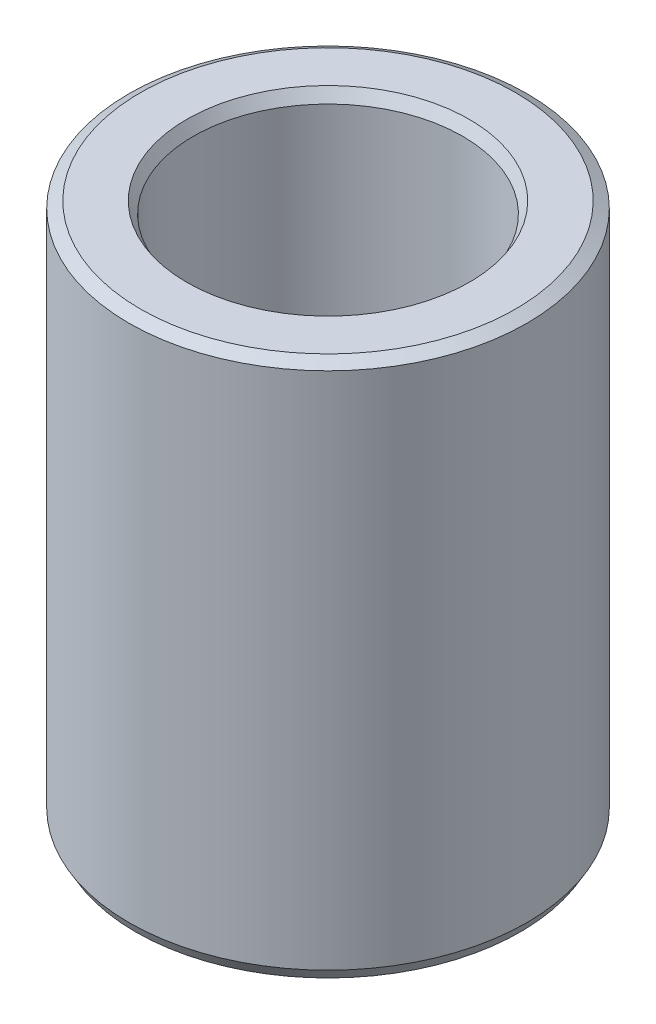
ISO-10303-21;
HEADER;
FILE_DESCRIPTION(('STEP AP214'),'2;1');
FILE_NAME('part.step','',(''),(''),'','','');
FILE_SCHEMA(('AUTOMOTIVE_DESIGN { 1 0 10303 214 1 1 1 1 }'));
ENDSEC;
DATA;
#1=APPLICATION_CONTEXT('core data for automotive mechanical design processes');
#2=APPLICATION_PROTOCOL_DEFINITION('international standard','automotive_design',2000,#1);
#3=PRODUCT_CONTEXT('',#1,'mechanical');
#4=PRODUCT('Part','Part','',(#3));
#5=PRODUCT_RELATED_PRODUCT_CATEGORY('part','',(#4));
#6=PRODUCT_DEFINITION_FORMATION('','',#4);
#7=PRODUCT_DEFINITION_CONTEXT('part definition',#1,'design');
#8=PRODUCT_DEFINITION('design','',#6,#7);
#9=PRODUCT_DEFINITION_SHAPE('','',#8);
#10=(LENGTH_UNIT() NAMED_UNIT(*) SI_UNIT(.MILLI.,.METRE.));
#11=(NAMED_UNIT(*) PLANE_ANGLE_UNIT() SI_UNIT($,.RADIAN.));
#12=(NAMED_UNIT(*) SI_UNIT($,.STERADIAN.) SOLID_ANGLE_UNIT());
#13=UNCERTAINTY_MEASURE_WITH_UNIT(LENGTH_MEASURE(1.E-05),#10,'distance_accuracy_value','');
#14=(GEOMETRIC_REPRESENTATION_CONTEXT(3) GLOBAL_UNCERTAINTY_ASSIGNED_CONTEXT((#13)) GLOBAL_UNIT_ASSIGNED_CONTEXT((#10,
#11,#12)) REPRESENTATION_CONTEXT('',''));
#15=CARTESIAN_POINT('',(0.,0.,0.));
#16=DIRECTION('',(0.,0.,1.));
#17=DIRECTION('',(1.,0.,0.));
#18=AXIS2_PLACEMENT_3D('',#15,#16,#17);
#19=CARTESIAN_POINT('',(0.,155.236634701129,0.));
#20=DIRECTION('',(0.,-1.,0.));
#21=DIRECTION('',(0.,0.,-1.));
#22=AXIS2_PLACEMENT_3D('',#19,#20,#21);
#23=CYLINDRICAL_SURFACE('',#22,57.5);
#24=CARTESIAN_POINT('',(0.,3.29462946241038,0.));
#25=DIRECTION('',(0.,1.,0.));
#26=DIRECTION('',(0.,0.,1.));
#27=AXIS2_PLACEMENT_3D('',#24,#25,#26);
#28=CIRCLE('',#27,57.5);
#29=CARTESIAN_POINT('',(0.,3.29462946241035,-57.5));
#30=VERTEX_POINT('',#29);
#31=EDGE_CURVE('E10',#30,#30,#28,.T.);
#32=CARTESIAN_POINT('',(0.,153.334479494126,0.));
#33=DIRECTION('',(0.,1.,0.));
#34=DIRECTION('',(0.,0.,1.));
#35=AXIS2_PLACEMENT_3D('',#32,#33,#34);
#36=CIRCLE('',#35,57.5);
#37=CARTESIAN_POINT('',(0.,153.334479494126,-57.5));
#38=VERTEX_POINT('',#37);
#39=EDGE_CURVE('E50',#38,#38,#36,.F.);
#40=CARTESIAN_POINT('',(0.,3.29462946241035,-57.5));
#41=CARTESIAN_POINT('',(0.,4.85754456690739,-57.5));
#42=CARTESIAN_POINT('',(0.,6.42045967140443,-57.5));
#43=CARTESIAN_POINT('',(0.,9.54628988039851,-57.5));
#44=CARTESIAN_POINT('',(0.,11.1092049848955,-57.5));
#45=CARTESIAN_POINT('',(0.,14.2350351938896,-57.5));
#46=CARTESIAN_POINT('',(0.,15.7979502983867,-57.5));
#47=CARTESIAN_POINT('',(0.,18.9237805073807,-57.5));
#48=CARTESIAN_POINT('',(0.,20.4866956118778,-57.5));
#49=CARTESIAN_POINT('',(0.,23.6125258208719,-57.5));
#50=CARTESIAN_POINT('',(0.,25.1754409253689,-57.5));
#51=CARTESIAN_POINT('',(0.,28.301271134363,-57.5));
#52=CARTESIAN_POINT('',(0.,29.86418623886,-57.5));
#53=CARTESIAN_POINT('',(0.,32.9900164478541,-57.5));
#54=CARTESIAN_POINT('',(0.,34.5529315523511,-57.5));
#55=CARTESIAN_POINT('',(0.,37.6787617613452,-57.5));
#56=CARTESIAN_POINT('',(0.,39.2416768658423,-57.5));
#57=CARTESIAN_POINT('',(0.,42.3675070748363,-57.5));
#58=CARTESIAN_POINT('',(0.,43.9304221793334,-57.5));
#59=CARTESIAN_POINT('',(0.,47.0562523883275,-57.5));
#60=CARTESIAN_POINT('',(0.,48.6191674928245,-57.5));
#61=CARTESIAN_POINT('',(0.,51.7449977018186,-57.5));
#62=CARTESIAN_POINT('',(0.,53.3079128063156,-57.5));
#63=CARTESIAN_POINT('',(0.,56.4337430153097,-57.5));
#64=CARTESIAN_POINT('',(0.,57.9966581198067,-57.5));
#65=CARTESIAN_POINT('',(0.,61.1224883288008,-57.5));
#66=CARTESIAN_POINT('',(0.,62.6854034332979,-57.5));
#67=CARTESIAN_POINT('',(0.,65.8112336422919,-57.5));
#68=CARTESIAN_POINT('',(0.,67.374148746789,-57.5));
#69=CARTESIAN_POINT('',(0.,70.4999789557831,-57.5));
#70=CARTESIAN_POINT('',(0.,72.0628940602801,-57.5));
#71=CARTESIAN_POINT('',(0.,75.1887242692742,-57.5));
#72=CARTESIAN_POINT('',(0.,76.7516393737712,-57.5));
#73=CARTESIAN_POINT('',(0.,79.8774695827653,-57.5));
#74=CARTESIAN_POINT('',(0.,81.4403846872624,-57.5));
#75=CARTESIAN_POINT('',(0.,84.5662148962564,-57.5));
#76=CARTESIAN_POINT('',(0.,86.1291300007535,-57.5));
#77=CARTESIAN_POINT('',(0.,89.2549602097476,-57.5));
#78=CARTESIAN_POINT('',(0.,90.8178753142446,-57.5));
#79=CARTESIAN_POINT('',(0.,93.9437055232387,-57.5));
#80=CARTESIAN_POINT('',(0.,95.5066206277357,-57.5));
#81=CARTESIAN_POINT('',(0.,98.6324508367298,-57.5));
#82=CARTESIAN_POINT('',(0.,100.195365941227,-57.5));
#83=CARTESIAN_POINT('',(0.,103.321196150221,-57.5));
#84=CARTESIAN_POINT('',(0.,104.884111254718,-57.5));
#85=CARTESIAN_POINT('',(0.,108.009941463712,-57.5));
#86=CARTESIAN_POINT('',(0.,109.572856568209,-57.5));
#87=CARTESIAN_POINT('',(0.,112.698686777203,-57.5));
#88=CARTESIAN_POINT('',(0.,114.2616018817,-57.5));
#89=CARTESIAN_POINT('',(0.,117.387432090694,-57.5));
#90=CARTESIAN_POINT('',(0.,118.950347195191,-57.5));
#91=CARTESIAN_POINT('',(0.,122.076177404185,-57.5));
#92=CARTESIAN_POINT('',(0.,123.639092508682,-57.5));
#93=CARTESIAN_POINT('',(0.,126.764922717676,-57.5));
#94=CARTESIAN_POINT('',(0.,128.327837822174,-57.5));
#95=CARTESIAN_POINT('',(0.,131.453668031168,-57.5));
#96=CARTESIAN_POINT('',(0.,133.016583135665,-57.5));
#97=CARTESIAN_POINT('',(0.,136.142413344659,-57.5));
#98=CARTESIAN_POINT('',(0.,137.705328449156,-57.5));
#99=CARTESIAN_POINT('',(0.,140.83115865815,-57.5));
#100=CARTESIAN_POINT('',(0.,142.394073762647,-57.5));
#101=CARTESIAN_POINT('',(0.,145.519903971641,-57.5));
#102=CARTESIAN_POINT('',(0.,147.082819076138,-57.5));
#103=CARTESIAN_POINT('',(0.,150.208649285132,-57.5));
#104=CARTESIAN_POINT('',(0.,151.771564389629,-57.5));
#105=CARTESIAN_POINT('',(0.,153.334479494126,-57.5));
#106=B_SPLINE_CURVE_WITH_KNOTS('',3,(#40,#41,#42,#43,#44,#45,#46,#47,#48,#49,#50,#51,#52,#53,
#54,#55,#56,#57,#58,#59,#60,#61,#62,#63,#64,#65,#66,#67,#68,#69,#70,#71,#72,#73,#74,#75,#76,#77,
#78,#79,#80,#81,#82,#83,#84,#85,#86,#87,#88,#89,#90,#91,#92,#93,#94,#95,#96,#97,#98,#99,#100,
#101,#102,#103,#104,#105),.UNSPECIFIED.,.F.,.F.,(4,2,2,2,2,2,2,2,2,2,2,2,2,2,2,2,2,2,2,2,2,2,2,
2,2,2,2,2,2,2,2,2,4),(0.,4.68874531349112,9.37749062698223,14.0662359404733,18.7549812539645,
23.4437265674556,28.1324718809467,32.8212171944378,37.5099625079289,42.1987078214201,
46.8874531349112,51.5761984484023,56.2649437618934,60.9536890753846,65.6424343888757,
70.3311797023668,75.0199250158579,79.708670329349,84.3974156428402,89.0861609563313,
93.7749062698224,98.4636515833135,103.152396896805,107.841142210296,112.529887523787,
117.218632837278,121.907378150769,126.59612346426,131.284868777751,135.973614091242,
140.662359404734,145.351104718225,150.039850031716),.UNSPECIFIED.);
#107=EDGE_CURVE('BSEAM39',#30,#38,#106,.T.);
#108=ORIENTED_EDGE('',*,*,#31,.T.);
#109=ORIENTED_EDGE('',*,*,#39,.T.);
#110=ORIENTED_EDGE('',*,*,#107,.T.);
#111=ORIENTED_EDGE('',*,*,#107,.F.);
#112=EDGE_LOOP('',(#108,#110,#109,#111));
#113=FACE_BOUND('',#112,.T.);
#114=ADVANCED_FACE('F39',(#113),#23,.T.);
#115=CARTESIAN_POINT('',(0.,155.236634701129,0.));
#116=DIRECTION('',(0.,1.,0.));
#117=DIRECTION('',(0.,0.,1.));
#118=AXIS2_PLACEMENT_3D('',#115,#116,#117);
#119=PLANE('',#118);
#120=CARTESIAN_POINT('',(0.,155.236634701129,0.));
#121=DIRECTION('',(0.,1.,0.));
#122=DIRECTION('',(0.,0.,1.));
#123=AXIS2_PLACEMENT_3D('',#120,#121,#122);
#124=CIRCLE('',#123,40.829257952996);
#125=CARTESIAN_POINT('',(0.,155.236634701129,40.829257952996));
#126=VERTEX_POINT('',#125);
#127=EDGE_CURVE('E58',#126,#126,#124,.F.);
#128=ORIENTED_EDGE('',*,*,#127,.T.);
#129=EDGE_LOOP('',(#128));
#130=FACE_BOUND('',#129,.T.);
#131=CARTESIAN_POINT('',(0.,155.236634701129,0.));
#132=DIRECTION('',(0.,1.,0.));
#133=DIRECTION('',(0.,0.,1.));
#134=AXIS2_PLACEMENT_3D('',#131,#132,#133);
#135=CIRCLE('',#134,54.2053705375901);
#136=CARTESIAN_POINT('',(0.,155.236634701129,54.2053705375901));
#137=VERTEX_POINT('',#136);
#138=EDGE_CURVE('E61',#137,#137,#135,.T.);
#139=ORIENTED_EDGE('',*,*,#138,.T.);
#140=EDGE_LOOP('',(#139));
#141=FACE_BOUND('',#140,.T.);
#142=ADVANCED_FACE('F88',(#130,#141),#119,.T.);
#143=CARTESIAN_POINT('',(0.,0.,0.));
#144=DIRECTION('',(0.,1.,0.));
#145=DIRECTION('',(0.,0.,1.));
#146=AXIS2_PLACEMENT_3D('',#143,#144,#145);
#147=PLANE('',#146);
#148=CARTESIAN_POINT('',(0.,0.,0.));
#149=DIRECTION('',(0.,1.,0.));
#150=DIRECTION('',(0.,0.,1.));
#151=AXIS2_PLACEMENT_3D('',#148,#149,#150);
#152=CIRCLE('',#151,42.2217322084032);
#153=CARTESIAN_POINT('',(0.,0.,-42.2217322084032));
#154=VERTEX_POINT('',#153);
#155=EDGE_CURVE('E51',#154,#154,#152,.T.);
#156=ORIENTED_EDGE('',*,*,#155,.T.);
#157=EDGE_LOOP('',(#156));
#158=FACE_BOUND('',#157,.T.);
#159=CARTESIAN_POINT('',(0.,0.,0.));
#160=DIRECTION('',(0.,1.,0.));
#161=DIRECTION('',(0.,0.,1.));
#162=AXIS2_PLACEMENT_3D('',#159,#160,#161);
#163=CIRCLE('',#162,55.5978447929973);
#164=CARTESIAN_POINT('',(0.,0.,55.5978447929973));
#165=VERTEX_POINT('',#164);
#166=EDGE_CURVE('E54',#165,#165,#163,.F.);
#167=ORIENTED_EDGE('',*,*,#166,.T.);
#168=EDGE_LOOP('',(#167));
#169=FACE_BOUND('',#168,.T.);
#170=ADVANCED_FACE('F83',(#158,#169),#147,.F.);
#171=CARTESIAN_POINT('',(0.,155.236634701129,0.));
#172=DIRECTION('',(0.,-1.,0.));
#173=DIRECTION('',(0.,0.,-1.));
#174=AXIS2_PLACEMENT_3D('',#171,#172,#173);
#175=CYLINDRICAL_SURFACE('',#174,38.9271027459933);
#176=CARTESIAN_POINT('',(0.,151.942005238718,0.));
#177=DIRECTION('',(0.,1.,0.));
#178=DIRECTION('',(0.,0.,1.));
#179=AXIS2_PLACEMENT_3D('',#176,#177,#178);
#180=CIRCLE('',#179,38.9271027459933);
#181=CARTESIAN_POINT('',(0.,151.942005238718,-38.9271027459933));
#182=VERTEX_POINT('',#181);
#183=EDGE_CURVE('E67',#182,#182,#180,.T.);
#184=CARTESIAN_POINT('',(0.,1.90215520700249,0.));
#185=DIRECTION('',(0.,1.,0.));
#186=DIRECTION('',(0.,0.,1.));
#187=AXIS2_PLACEMENT_3D('',#184,#185,#186);
#188=CIRCLE('',#187,38.9271027459933);
#189=CARTESIAN_POINT('',(0.,1.90215520700246,-38.9271027459933));
#190=VERTEX_POINT('',#189);
#191=EDGE_CURVE('E69',#190,#190,#188,.F.);
#192=CARTESIAN_POINT('',(0.,151.942005238718,-38.9271027459933));
#193=CARTESIAN_POINT('',(0.,150.379090134221,-38.9271027459933));
#194=CARTESIAN_POINT('',(0.,148.816175029724,-38.9271027459933));
#195=CARTESIAN_POINT('',(0.,145.69034482073,-38.9271027459933));
#196=CARTESIAN_POINT('',(0.,144.127429716233,-38.9271027459933));
#197=CARTESIAN_POINT('',(0.,141.001599507239,-38.9271027459933));
#198=CARTESIAN_POINT('',(0.,139.438684402742,-38.9271027459933));
#199=CARTESIAN_POINT('',(0.,136.312854193748,-38.9271027459933));
#200=CARTESIAN_POINT('',(0.,134.749939089251,-38.9271027459933));
#201=CARTESIAN_POINT('',(0.,131.624108880257,-38.9271027459933));
#202=CARTESIAN_POINT('',(0.,130.06119377576,-38.9271027459933));
#203=CARTESIAN_POINT('',(0.,126.935363566766,-38.9271027459933));
#204=CARTESIAN_POINT('',(0.,125.372448462269,-38.9271027459933));
#205=CARTESIAN_POINT('',(0.,122.246618253275,-38.9271027459933));
#206=CARTESIAN_POINT('',(0.,120.683703148778,-38.9271027459933));
#207=CARTESIAN_POINT('',(0.,117.557872939783,-38.9271027459933));
#208=CARTESIAN_POINT('',(0.,115.994957835286,-38.9271027459933));
#209=CARTESIAN_POINT('',(0.,112.869127626292,-38.9271027459933));
#210=CARTESIAN_POINT('',(0.,111.306212521795,-38.9271027459933));
#211=CARTESIAN_POINT('',(0.,108.180382312801,-38.9271027459933));
#212=CARTESIAN_POINT('',(0.,106.617467208304,-38.9271027459933));
#213=CARTESIAN_POINT('',(0.,103.49163699931,-38.9271027459933));
#214=CARTESIAN_POINT('',(0.,101.928721894813,-38.9271027459933));
#215=CARTESIAN_POINT('',(0.,98.8028916858189,-38.9271027459933));
#216=CARTESIAN_POINT('',(0.,97.2399765813219,-38.9271027459933));
#217=CARTESIAN_POINT('',(0.,94.1141463723278,-38.9271027459933));
#218=CARTESIAN_POINT('',(0.,92.5512312678308,-38.9271027459933));
#219=CARTESIAN_POINT('',(0.,89.4254010588367,-38.9271027459933));
#220=CARTESIAN_POINT('',(0.,87.8624859543397,-38.9271027459933));
#221=CARTESIAN_POINT('',(0.,84.7366557453456,-38.9271027459933));
#222=CARTESIAN_POINT('',(0.,83.1737406408485,-38.9271027459933));
#223=CARTESIAN_POINT('',(0.,80.0479104318545,-38.9271027459933));
#224=CARTESIAN_POINT('',(0.,78.4849953273574,-38.9271027459933));
#225=CARTESIAN_POINT('',(0.,75.3591651183634,-38.9271027459933));
#226=CARTESIAN_POINT('',(0.,73.7962500138663,-38.9271027459933));
#227=CARTESIAN_POINT('',(0.,70.6704198048722,-38.9271027459933));
#228=CARTESIAN_POINT('',(0.,69.1075047003752,-38.9271027459933));
#229=CARTESIAN_POINT('',(0.,65.9816744913811,-38.9271027459933));
#230=CARTESIAN_POINT('',(0.,64.4187593868841,-38.9271027459933));
#231=CARTESIAN_POINT('',(0.,61.29292917789,-38.9271027459933));
#232=CARTESIAN_POINT('',(0.,59.730014073393,-38.9271027459933));
#233=CARTESIAN_POINT('',(0.,56.6041838643989,-38.9271027459933));
#234=CARTESIAN_POINT('',(0.,55.0412687599018,-38.9271027459933));
#235=CARTESIAN_POINT('',(0.,51.9154385509077,-38.9271027459933));
#236=CARTESIAN_POINT('',(0.,50.3525234464107,-38.9271027459933));
#237=CARTESIAN_POINT('',(0.,47.2266932374166,-38.9271027459933));
#238=CARTESIAN_POINT('',(0.,45.6637781329196,-38.9271027459933));
#239=CARTESIAN_POINT('',(0.,42.5379479239255,-38.9271027459933));
#240=CARTESIAN_POINT('',(0.,40.9750328194285,-38.9271027459933));
#241=CARTESIAN_POINT('',(0.,37.8492026104344,-38.9271027459933));
#242=CARTESIAN_POINT('',(0.,36.2862875059373,-38.9271027459933));
#243=CARTESIAN_POINT('',(0.,33.1604572969433,-38.9271027459933));
#244=CARTESIAN_POINT('',(0.,31.5975421924462,-38.9271027459933));
#245=CARTESIAN_POINT('',(0.,28.4717119834521,-38.9271027459933));
#246=CARTESIAN_POINT('',(0.,26.9087968789551,-38.9271027459933));
#247=CARTESIAN_POINT('',(0.,23.782966669961,-38.9271027459933));
#248=CARTESIAN_POINT('',(0.,22.220051565464,-38.9271027459933));
#249=CARTESIAN_POINT('',(0.,19.0942213564699,-38.9271027459933));
#250=CARTESIAN_POINT('',(0.,17.5313062519729,-38.9271027459933));
#251=CARTESIAN_POINT('',(0.,14.4054760429788,-38.9271027459933));
#252=CARTESIAN_POINT('',(0.,12.8425609384817,-38.9271027459933));
#253=CARTESIAN_POINT('',(0.,9.71673072948765,-38.9271027459933));
#254=CARTESIAN_POINT('',(0.,8.15381562499062,-38.9271027459933));
#255=CARTESIAN_POINT('',(0.,5.02798541599654,-38.9271027459933));
#256=CARTESIAN_POINT('',(0.,3.4650703114995,-38.9271027459933));
#257=CARTESIAN_POINT('',(0.,1.90215520700246,-38.9271027459933));
#258=B_SPLINE_CURVE_WITH_KNOTS('',3,(#192,#193,#194,#195,#196,#197,#198,#199,#200,#201,#202,
#203,#204,#205,#206,#207,#208,#209,#210,#211,#212,#213,#214,#215,#216,#217,#218,#219,#220,#221,
#222,#223,#224,#225,#226,#227,#228,#229,#230,#231,#232,#233,#234,#235,#236,#237,#238,#239,#240,
#241,#242,#243,#244,#245,#246,#247,#248,#249,#250,#251,#252,#253,#254,#255,#256,#257),
.UNSPECIFIED.,.F.,.F.,(4,2,2,2,2,2,2,2,2,2,2,2,2,2,2,2,2,2,2,2,2,2,2,2,2,2,2,2,2,2,2,2,4),(0.,
4.68874531349112,9.37749062698223,14.0662359404733,18.7549812539645,23.4437265674556,
28.1324718809467,32.8212171944378,37.5099625079289,42.1987078214201,46.8874531349112,
51.5761984484023,56.2649437618934,60.9536890753845,65.6424343888757,70.3311797023668,
75.0199250158579,79.708670329349,84.3974156428401,89.0861609563313,93.7749062698224,
98.4636515833135,103.152396896805,107.841142210296,112.529887523787,117.218632837278,
121.907378150769,126.59612346426,131.284868777751,135.973614091242,140.662359404734,
145.351104718225,150.039850031716),.UNSPECIFIED.);
#259=EDGE_CURVE('BSEAM71',#182,#190,#258,.T.);
#260=ORIENTED_EDGE('',*,*,#183,.T.);
#261=ORIENTED_EDGE('',*,*,#191,.T.);
#262=ORIENTED_EDGE('',*,*,#259,.T.);
#263=ORIENTED_EDGE('',*,*,#259,.F.);
#264=EDGE_LOOP('',(#260,#262,#261,#263));
#265=FACE_BOUND('',#264,.T.);
#266=ADVANCED_FACE('F71',(#265),#175,.F.);
#267=CARTESIAN_POINT('',(0.,151.942005238718,0.));
#268=DIRECTION('',(0.,1.,0.));
#269=DIRECTION('',(0.,0.,1.));
#270=AXIS2_PLACEMENT_3D('',#267,#268,#269);
#271=CONICAL_SURFACE('',#270,38.9271027459933,0.523598775598301);
#272=ORIENTED_EDGE('',*,*,#127,.F.);
#273=EDGE_LOOP('',(#272));
#274=FACE_BOUND('',#273,.T.);
#275=ORIENTED_EDGE('',*,*,#183,.F.);
#276=EDGE_LOOP('',(#275));
#277=FACE_BOUND('',#276,.T.);
#278=ADVANCED_FACE('F77',(#274,#277),#271,.F.);
#279=CARTESIAN_POINT('',(0.,0.,0.));
#280=DIRECTION('',(0.,-1.,0.));
#281=DIRECTION('',(0.,0.,-1.));
#282=AXIS2_PLACEMENT_3D('',#279,#280,#281);
#283=CONICAL_SURFACE('',#282,42.2217322084032,1.0471975511966);
#284=CARTESIAN_POINT('',(0.,1.90215520700249,-38.9271027459933));
#285=CARTESIAN_POINT('',(0.,1.88234109026288,-38.9614218028934));
#286=CARTESIAN_POINT('',(0.,1.86252697352327,-38.9957408597935));
#287=CARTESIAN_POINT('',(0.,1.82289874004405,-39.0643789735937));
#288=CARTESIAN_POINT('',(0.,1.80308462330444,-39.0986980304938));
#289=CARTESIAN_POINT('',(0.,1.76345638982522,-39.167336144294));
#290=CARTESIAN_POINT('',(0.,1.74364227308561,-39.2016552011941));
#291=CARTESIAN_POINT('',(0.,1.70401403960639,-39.2702933149943));
#292=CARTESIAN_POINT('',(0.,1.68419992286679,-39.3046123718944));
#293=CARTESIAN_POINT('',(0.,1.64457168938757,-39.3732504856946));
#294=CARTESIAN_POINT('',(0.,1.62475757264796,-39.4075695425947));
#295=CARTESIAN_POINT('',(0.,1.58512933916874,-39.4762076563949));
#296=CARTESIAN_POINT('',(0.,1.56531522242913,-39.510526713295));
#297=CARTESIAN_POINT('',(0.,1.52568698894991,-39.5791648270952));
#298=CARTESIAN_POINT('',(0.,1.5058728722103,-39.6134838839953));
#299=CARTESIAN_POINT('',(0.,1.46624463873108,-39.6821219977955));
#300=CARTESIAN_POINT('',(0.,1.44643052199147,-39.7164410546957));
#301=CARTESIAN_POINT('',(0.,1.40680228851226,-39.7850791684959));
#302=CARTESIAN_POINT('',(0.,1.38698817177265,-39.819398225396));
#303=CARTESIAN_POINT('',(0.,1.34735993829343,-39.8880363391962));
#304=CARTESIAN_POINT('',(0.,1.32754582155382,-39.9223553960963));
#305=CARTESIAN_POINT('',(0.,1.2879175880746,-39.9909935098965));
#306=CARTESIAN_POINT('',(0.,1.26810347133499,-40.0253125667966));
#307=CARTESIAN_POINT('',(0.,1.22847523785577,-40.0939506805968));
#308=CARTESIAN_POINT('',(0.,1.20866112111616,-40.1282697374969));
#309=CARTESIAN_POINT('',(0.,1.16903288763695,-40.1969078512971));
#310=CARTESIAN_POINT('',(0.,1.14921877089734,-40.2312269081972));
#311=CARTESIAN_POINT('',(0.,1.10959053741812,-40.2998650219974));
#312=CARTESIAN_POINT('',(0.,1.08977642067851,-40.3341840788975));
#313=CARTESIAN_POINT('',(0.,1.05014818719929,-40.4028221926977));
#314=CARTESIAN_POINT('',(0.,1.03033407045968,-40.4371412495978));
#315=CARTESIAN_POINT('',(0.,0.990705836980461,-40.505779363398));
#316=CARTESIAN_POINT('',(0.,0.970891720240853,-40.5400984202982));
#317=CARTESIAN_POINT('',(0.,0.931263486761635,-40.6087365340984));
#318=CARTESIAN_POINT('',(0.,0.911449370022025,-40.6430555909985));
#319=CARTESIAN_POINT('',(0.,0.871821136542806,-40.7116937047987));
#320=CARTESIAN_POINT('',(0.,0.852007019803196,-40.7460127616988));
#321=CARTESIAN_POINT('',(0.,0.812378786323979,-40.814650875499));
#322=CARTESIAN_POINT('',(0.,0.79256466958437,-40.8489699323991));
#323=CARTESIAN_POINT('',(0.,0.752936436105151,-40.9176080461993));
#324=CARTESIAN_POINT('',(0.,0.733122319365541,-40.9519271030994));
#325=CARTESIAN_POINT('',(0.,0.693494085886323,-41.0205652168996));
#326=CARTESIAN_POINT('',(0.,0.673679969146715,-41.0548842737997));
#327=CARTESIAN_POINT('',(0.,0.634051735667496,-41.1235223875999));
#328=CARTESIAN_POINT('',(0.,0.614237618927886,-41.1578414445));
#329=CARTESIAN_POINT('',(0.,0.574609385448667,-41.2264795583002));
#330=CARTESIAN_POINT('',(0.,0.554795268709059,-41.2607986152003));
#331=CARTESIAN_POINT('',(0.,0.515167035229841,-41.3294367290005));
#332=CARTESIAN_POINT('',(0.,0.49535291849023,-41.3637557859006));
#333=CARTESIAN_POINT('',(0.,0.455724685011012,-41.4323938997009));
#334=CARTESIAN_POINT('',(0.,0.435910568271404,-41.466712956601));
#335=CARTESIAN_POINT('',(0.,0.396282334792185,-41.5353510704012));
#336=CARTESIAN_POINT('',(0.,0.376468218052575,-41.5696701273013));
#337=CARTESIAN_POINT('',(0.,0.336839984573357,-41.6383082411015));
#338=CARTESIAN_POINT('',(0.,0.317025867833748,-41.6726272980016));
#339=CARTESIAN_POINT('',(0.,0.27739763435453,-41.7412654118018));
#340=CARTESIAN_POINT('',(0.,0.25758351761492,-41.7755844687019));
#341=CARTESIAN_POINT('',(0.,0.217955284135701,-41.8442225825021));
#342=CARTESIAN_POINT('',(0.,0.198141167396093,-41.8785416394022));
#343=CARTESIAN_POINT('',(0.,0.158512933916874,-41.9471797532024));
#344=CARTESIAN_POINT('',(0.,0.138698817177264,-41.9814988101025));
#345=CARTESIAN_POINT('',(0.,0.0990705836980456,-42.0501369239027));
#346=CARTESIAN_POINT('',(0.,0.0792564669584369,-42.0844559808028));
#347=CARTESIAN_POINT('',(0.,0.0396282334792196,-42.153094094603));
#348=CARTESIAN_POINT('',(0.,0.0198141167396109,-42.1874131515031));
#349=CARTESIAN_POINT('',(0.,0.,-42.2217322084032));
#350=B_SPLINE_CURVE_WITH_KNOTS('',3,(#284,#285,#286,#287,#288,#289,#290,#291,#292,#293,#294,
#295,#296,#297,#298,#299,#300,#301,#302,#303,#304,#305,#306,#307,#308,#309,#310,#311,#312,#313,
#314,#315,#316,#317,#318,#319,#320,#321,#322,#323,#324,#325,#326,#327,#328,#329,#330,#331,#332,
#333,#334,#335,#336,#337,#338,#339,#340,#341,#342,#343,#344,#345,#346,#347,#348,#349),
.UNSPECIFIED.,.F.,.F.,(4,2,2,2,2,2,2,2,2,2,2,2,2,2,2,2,2,2,2,2,2,2,2,2,2,2,2,2,2,2,2,2,4),(0.,
0.118884700437658,0.23776940087531,0.356654101312963,0.475538801750621,0.594423502188273,
0.713308202625931,0.832192903063583,0.951077603501241,1.06996230393889,1.18884700437655,
1.3077317048142,1.42661640525186,1.54550110568951,1.66438580612717,1.78327050656483,
1.90215520700248,2.02103990744014,2.13992460787779,2.25880930831545,2.3776940087531,
2.49657870919076,2.61546340962841,2.73434811006607,2.85323281050372,2.97211751094138,
3.09100221137903,3.20988691181669,3.32877161225434,3.447656312692,3.56654101312965,
3.68542571356731,3.80431041400496),.UNSPECIFIED.);
#351=EDGE_CURVE('BSEAM73',#190,#154,#350,.T.);
#352=ORIENTED_EDGE('',*,*,#191,.F.);
#353=ORIENTED_EDGE('',*,*,#155,.F.);
#354=ORIENTED_EDGE('',*,*,#351,.T.);
#355=ORIENTED_EDGE('',*,*,#351,.F.);
#356=EDGE_LOOP('',(#352,#354,#353,#355));
#357=FACE_BOUND('',#356,.T.);
#358=ADVANCED_FACE('F73',(#357),#283,.F.);
#359=CARTESIAN_POINT('',(0.,3.29462946241038,0.));
#360=DIRECTION('',(0.,1.,0.));
#361=DIRECTION('',(0.,0.,1.));
#362=AXIS2_PLACEMENT_3D('',#359,#360,#361);
#363=CONICAL_SURFACE('',#362,57.5,0.523598775598306);
#364=ORIENTED_EDGE('',*,*,#166,.F.);
#365=EDGE_LOOP('',(#364));
#366=FACE_BOUND('',#365,.T.);
#367=ORIENTED_EDGE('',*,*,#31,.F.);
#368=EDGE_LOOP('',(#367));
#369=FACE_BOUND('',#368,.T.);
#370=ADVANCED_FACE('F76',(#366,#369),#363,.T.);
#371=CARTESIAN_POINT('',(0.,155.236634701129,0.));
#372=DIRECTION('',(0.,-1.,0.));
#373=DIRECTION('',(0.,0.,-1.));
#374=AXIS2_PLACEMENT_3D('',#371,#372,#373);
#375=CONICAL_SURFACE('',#374,54.2053705375901,1.04719755119659);
#376=ORIENTED_EDGE('',*,*,#39,.F.);
#377=EDGE_LOOP('',(#376));
#378=FACE_BOUND('',#377,.T.);
#379=ORIENTED_EDGE('',*,*,#138,.F.);
#380=EDGE_LOOP('',(#379));
#381=FACE_BOUND('',#380,.T.);
#382=ADVANCED_FACE('F45',(#378,#381),#375,.T.);
#383=CLOSED_SHELL('',(#114,#142,#170,#266,#278,#358,#370,#382));
#384=MANIFOLD_SOLID_BREP('B2',#383);
#385=ADVANCED_BREP_SHAPE_REPRESENTATION('',(#18,#384),#14);
#386=SHAPE_DEFINITION_REPRESENTATION(#9,#385);
ENDSEC;
END-ISO-10303-21;
